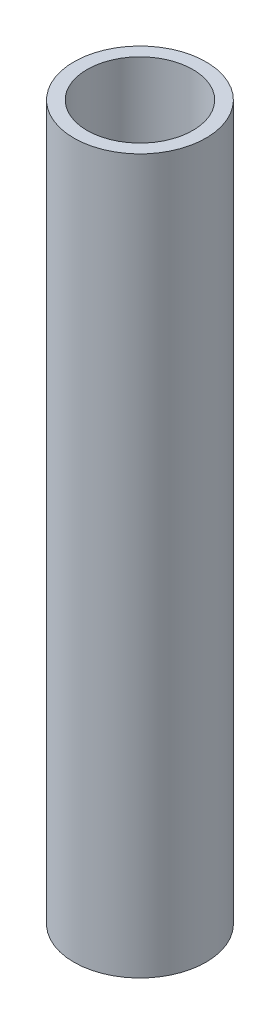
ISO-10303-21;
HEADER;
FILE_DESCRIPTION(('STEP AP214'),'2;1');
FILE_NAME('part.step','',(''),(''),'','','');
FILE_SCHEMA(('AUTOMOTIVE_DESIGN { 1 0 10303 214 1 1 1 1 }'));
ENDSEC;
DATA;
#1=APPLICATION_CONTEXT('core data for automotive mechanical design processes');
#2=APPLICATION_PROTOCOL_DEFINITION('international standard','automotive_design',2000,#1);
#3=PRODUCT_CONTEXT('',#1,'mechanical');
#4=PRODUCT('Part','Part','',(#3));
#5=PRODUCT_RELATED_PRODUCT_CATEGORY('part','',(#4));
#6=PRODUCT_DEFINITION_FORMATION('','',#4);
#7=PRODUCT_DEFINITION_CONTEXT('part definition',#1,'design');
#8=PRODUCT_DEFINITION('design','',#6,#7);
#9=PRODUCT_DEFINITION_SHAPE('','',#8);
#10=(LENGTH_UNIT() NAMED_UNIT(*) SI_UNIT(.MILLI.,.METRE.));
#11=(NAMED_UNIT(*) PLANE_ANGLE_UNIT() SI_UNIT($,.RADIAN.));
#12=(NAMED_UNIT(*) SI_UNIT($,.STERADIAN.) SOLID_ANGLE_UNIT());
#13=UNCERTAINTY_MEASURE_WITH_UNIT(LENGTH_MEASURE(1.E-05),#10,'distance_accuracy_value','');
#14=(GEOMETRIC_REPRESENTATION_CONTEXT(3) GLOBAL_UNCERTAINTY_ASSIGNED_CONTEXT((#13)) GLOBAL_UNIT_ASSIGNED_CONTEXT((#10,
#11,#12)) REPRESENTATION_CONTEXT('',''));
#15=CARTESIAN_POINT('',(0.,0.,0.));
#16=DIRECTION('',(0.,0.,1.));
#17=DIRECTION('',(1.,0.,0.));
#18=AXIS2_PLACEMENT_3D('',#15,#16,#17);
#19=CARTESIAN_POINT('',(0.,54.,0.));
#20=DIRECTION('',(0.,1.,0.));
#21=DIRECTION('',(0.,0.,1.));
#22=AXIS2_PLACEMENT_3D('',#19,#20,#21);
#23=PLANE('',#22);
#24=CARTESIAN_POINT('',(0.,54.,0.));
#25=DIRECTION('',(0.,1.,0.));
#26=DIRECTION('',(0.,0.,1.));
#27=AXIS2_PLACEMENT_3D('',#24,#25,#26);
#28=CIRCLE('',#27,5.);
#29=CARTESIAN_POINT('',(0.,54.,5.));
#30=VERTEX_POINT('',#29);
#31=EDGE_CURVE('E10',#30,#30,#28,.T.);
#32=ORIENTED_EDGE('',*,*,#31,.T.);
#33=EDGE_LOOP('',(#32));
#34=FACE_BOUND('',#33,.T.);
#35=CARTESIAN_POINT('',(0.,54.,0.));
#36=DIRECTION('',(0.,1.,0.));
#37=DIRECTION('',(0.,0.,1.));
#38=AXIS2_PLACEMENT_3D('',#35,#36,#37);
#39=CIRCLE('',#38,4.);
#40=CARTESIAN_POINT('',(0.,54.,4.));
#41=VERTEX_POINT('',#40);
#42=EDGE_CURVE('E43',#41,#41,#39,.T.);
#43=ORIENTED_EDGE('',*,*,#42,.F.);
#44=EDGE_LOOP('',(#43));
#45=FACE_BOUND('',#44,.T.);
#46=ADVANCED_FACE('F32',(#34,#45),#23,.T.);
#47=CARTESIAN_POINT('',(0.,0.,0.));
#48=DIRECTION('',(0.,1.,0.));
#49=DIRECTION('',(0.,0.,1.));
#50=AXIS2_PLACEMENT_3D('',#47,#48,#49);
#51=PLANE('',#50);
#52=CARTESIAN_POINT('',(0.,0.,0.));
#53=DIRECTION('',(0.,1.,0.));
#54=DIRECTION('',(0.,0.,1.));
#55=AXIS2_PLACEMENT_3D('',#52,#53,#54);
#56=CIRCLE('',#55,5.);
#57=CARTESIAN_POINT('',(0.,0.,5.));
#58=VERTEX_POINT('',#57);
#59=EDGE_CURVE('E36',#58,#58,#56,.T.);
#60=ORIENTED_EDGE('',*,*,#59,.F.);
#61=EDGE_LOOP('',(#60));
#62=FACE_BOUND('',#61,.T.);
#63=CARTESIAN_POINT('',(0.,0.,0.));
#64=DIRECTION('',(0.,1.,0.));
#65=DIRECTION('',(0.,0.,1.));
#66=AXIS2_PLACEMENT_3D('',#63,#64,#65);
#67=CIRCLE('',#66,4.);
#68=CARTESIAN_POINT('',(0.,0.,4.));
#69=VERTEX_POINT('',#68);
#70=EDGE_CURVE('E45',#69,#69,#67,.T.);
#71=ORIENTED_EDGE('',*,*,#70,.T.);
#72=EDGE_LOOP('',(#71));
#73=FACE_BOUND('',#72,.T.);
#74=ADVANCED_FACE('F55',(#62,#73),#51,.F.);
#75=CARTESIAN_POINT('',(0.,54.,0.));
#76=DIRECTION('',(0.,-1.,0.));
#77=DIRECTION('',(0.,0.,-1.));
#78=AXIS2_PLACEMENT_3D('',#75,#76,#77);
#79=CYLINDRICAL_SURFACE('',#78,5.);
#80=ORIENTED_EDGE('',*,*,#31,.F.);
#81=EDGE_LOOP('',(#80));
#82=FACE_BOUND('',#81,.T.);
#83=ORIENTED_EDGE('',*,*,#59,.T.);
#84=EDGE_LOOP('',(#83));
#85=FACE_BOUND('',#84,.T.);
#86=ADVANCED_FACE('F34',(#82,#85),#79,.T.);
#87=CARTESIAN_POINT('',(0.,54.,0.));
#88=DIRECTION('',(0.,-1.,0.));
#89=DIRECTION('',(0.,0.,-1.));
#90=AXIS2_PLACEMENT_3D('',#87,#88,#89);
#91=CYLINDRICAL_SURFACE('',#90,4.);
#92=ORIENTED_EDGE('',*,*,#42,.T.);
#93=EDGE_LOOP('',(#92));
#94=FACE_BOUND('',#93,.T.);
#95=ORIENTED_EDGE('',*,*,#70,.F.);
#96=EDGE_LOOP('',(#95));
#97=FACE_BOUND('',#96,.T.);
#98=ADVANCED_FACE('F51',(#94,#97),#91,.F.);
#99=CLOSED_SHELL('',(#46,#74,#86,#98));
#100=MANIFOLD_SOLID_BREP('B2',#99);
#101=ADVANCED_BREP_SHAPE_REPRESENTATION('',(#18,#100),#14);
#102=SHAPE_DEFINITION_REPRESENTATION(#9,#101);
ENDSEC;
END-ISO-10303-21;
